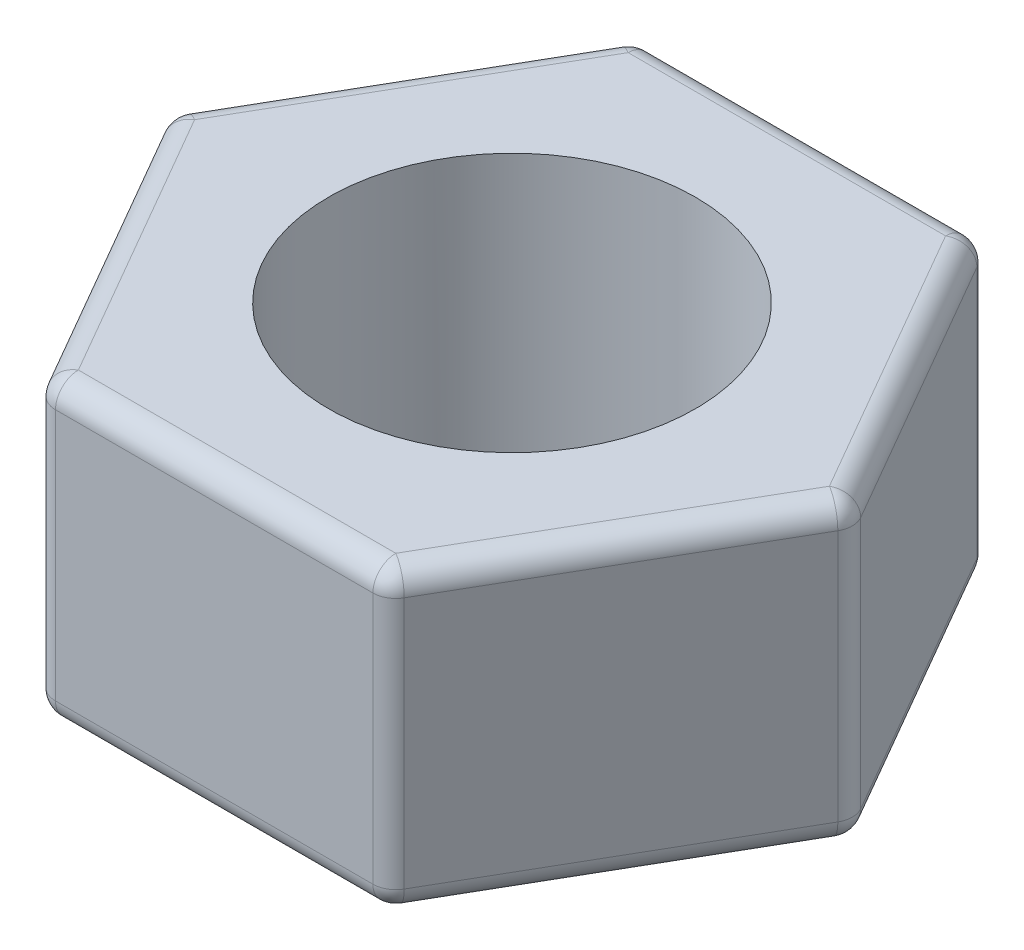
ISO-10303-21;
HEADER;
FILE_DESCRIPTION(('STEP AP214'),'2;1');
FILE_NAME('part.step','',(''),(''),'','','');
FILE_SCHEMA(('AUTOMOTIVE_DESIGN { 1 0 10303 214 1 1 1 1 }'));
ENDSEC;
DATA;
#1=APPLICATION_CONTEXT('core data for automotive mechanical design processes');
#2=APPLICATION_PROTOCOL_DEFINITION('international standard','automotive_design',2000,#1);
#3=PRODUCT_CONTEXT('',#1,'mechanical');
#4=PRODUCT('Part','Part','',(#3));
#5=PRODUCT_RELATED_PRODUCT_CATEGORY('part','',(#4));
#6=PRODUCT_DEFINITION_FORMATION('','',#4);
#7=PRODUCT_DEFINITION_CONTEXT('part definition',#1,'design');
#8=PRODUCT_DEFINITION('design','',#6,#7);
#9=PRODUCT_DEFINITION_SHAPE('','',#8);
#10=(LENGTH_UNIT() NAMED_UNIT(*) SI_UNIT(.MILLI.,.METRE.));
#11=(NAMED_UNIT(*) PLANE_ANGLE_UNIT() SI_UNIT($,.RADIAN.));
#12=(NAMED_UNIT(*) SI_UNIT($,.STERADIAN.) SOLID_ANGLE_UNIT());
#13=UNCERTAINTY_MEASURE_WITH_UNIT(LENGTH_MEASURE(1.E-05),#10,'distance_accuracy_value','');
#14=(GEOMETRIC_REPRESENTATION_CONTEXT(3) GLOBAL_UNCERTAINTY_ASSIGNED_CONTEXT((#13)) GLOBAL_UNIT_ASSIGNED_CONTEXT((#10,
#11,#12)) REPRESENTATION_CONTEXT('',''));
#15=CARTESIAN_POINT('',(0.,0.,0.));
#16=DIRECTION('',(0.,0.,1.));
#17=DIRECTION('',(1.,0.,0.));
#18=AXIS2_PLACEMENT_3D('',#15,#16,#17);
#19=CARTESIAN_POINT('',(3.75000000000008,6.5,6.49519052838325));
#20=DIRECTION('',(-0.866025403784442,0.,-0.499999999999995));
#21=DIRECTION('',(-0.499999999999995,0.,0.866025403784442));
#22=AXIS2_PLACEMENT_3D('',#19,#20,#21);
#23=PLANE('',#22);
#24=DIRECTION('',(0.499999999999995,0.,-0.866025403784442));
#25=VECTOR('',#24,1.);
#26=CARTESIAN_POINT('',(3.75000000000008,6.,6.49519052838325));
#27=LINE('',#26,#25);
#28=CARTESIAN_POINT('',(7.3556624327026,6.,0.249999999999999));
#29=VERTEX_POINT('',#28);
#30=CARTESIAN_POINT('',(3.89433756729748,6.,6.24519052838325));
#31=VERTEX_POINT('',#30);
#32=EDGE_CURVE('E189',#29,#31,#27,.F.);
#33=ORIENTED_EDGE('',*,*,#32,.T.);
#34=DIRECTION('',(0.,-1.,0.));
#35=VECTOR('',#34,1.);
#36=CARTESIAN_POINT('',(3.89433756729748,6.5,6.24519052838325));
#37=LINE('',#36,#35);
#38=CARTESIAN_POINT('',(3.89433756729748,0.5,6.24519052838325));
#39=VERTEX_POINT('',#38);
#40=EDGE_CURVE('E346',#31,#39,#37,.T.);
#41=ORIENTED_EDGE('',*,*,#40,.T.);
#42=DIRECTION('',(0.499999999999995,0.,-0.866025403784442));
#43=VECTOR('',#42,1.);
#44=CARTESIAN_POINT('',(3.75000000000008,0.5,6.49519052838325));
#45=LINE('',#44,#43);
#46=CARTESIAN_POINT('',(7.3556624327026,0.5,0.249999999999999));
#47=VERTEX_POINT('',#46);
#48=EDGE_CURVE('E343',#39,#47,#45,.T.);
#49=ORIENTED_EDGE('',*,*,#48,.T.);
#50=DIRECTION('',(0.,-1.,0.));
#51=VECTOR('',#50,1.);
#52=CARTESIAN_POINT('',(7.3556624327026,6.5,0.249999999999999));
#53=LINE('',#52,#51);
#54=EDGE_CURVE('E341',#47,#29,#53,.F.);
#55=ORIENTED_EDGE('',*,*,#54,.T.);
#56=EDGE_LOOP('',(#33,#41,#49,#55));
#57=FACE_BOUND('',#56,.T.);
#58=ADVANCED_FACE('F31',(#57),#23,.F.);
#59=CARTESIAN_POINT('',(7.5,6.5,0.));
#60=DIRECTION('',(-0.866025403784438,0.,0.500000000000001));
#61=DIRECTION('',(0.500000000000001,0.,0.866025403784438));
#62=AXIS2_PLACEMENT_3D('',#59,#60,#61);
#63=PLANE('',#62);
#64=DIRECTION('',(-0.500000000000001,0.,-0.866025403784438));
#65=VECTOR('',#64,1.);
#66=CARTESIAN_POINT('',(7.5,6.,0.));
#67=LINE('',#66,#65);
#68=CARTESIAN_POINT('',(3.89433756729739,6.,-6.2451905283833));
#69=VERTEX_POINT('',#68);
#70=CARTESIAN_POINT('',(7.35566243270259,6.,-0.249999999999999));
#71=VERTEX_POINT('',#70);
#72=EDGE_CURVE('E46',#69,#71,#67,.F.);
#73=ORIENTED_EDGE('',*,*,#72,.T.);
#74=DIRECTION('',(0.,-1.,0.));
#75=VECTOR('',#74,1.);
#76=CARTESIAN_POINT('',(7.35566243270259,6.5,-0.249999999999999));
#77=LINE('',#76,#75);
#78=CARTESIAN_POINT('',(7.35566243270259,0.5,-0.249999999999999));
#79=VERTEX_POINT('',#78);
#80=EDGE_CURVE('E267',#71,#79,#77,.T.);
#81=ORIENTED_EDGE('',*,*,#80,.T.);
#82=DIRECTION('',(-0.500000000000001,0.,-0.866025403784438));
#83=VECTOR('',#82,1.);
#84=CARTESIAN_POINT('',(7.5,0.5,0.));
#85=LINE('',#84,#83);
#86=CARTESIAN_POINT('',(3.89433756729739,0.5,-6.2451905283833));
#87=VERTEX_POINT('',#86);
#88=EDGE_CURVE('E362',#79,#87,#85,.T.);
#89=ORIENTED_EDGE('',*,*,#88,.T.);
#90=DIRECTION('',(0.,-1.,0.));
#91=VECTOR('',#90,1.);
#92=CARTESIAN_POINT('',(3.89433756729739,6.5,-6.2451905283833));
#93=LINE('',#92,#91);
#94=EDGE_CURVE('E51',#87,#69,#93,.F.);
#95=ORIENTED_EDGE('',*,*,#94,.T.);
#96=EDGE_LOOP('',(#73,#81,#89,#95));
#97=FACE_BOUND('',#96,.T.);
#98=ADVANCED_FACE('F364',(#97),#63,.F.);
#99=CARTESIAN_POINT('',(3.74999999999998,6.5,-6.4951905283833));
#100=DIRECTION('',(0.,0.,1.));
#101=DIRECTION('',(1.,0.,0.));
#102=AXIS2_PLACEMENT_3D('',#99,#100,#101);
#103=PLANE('',#102);
#104=DIRECTION('',(0.,-1.,0.));
#105=VECTOR('',#104,1.);
#106=CARTESIAN_POINT('',(-3.46132486540522,6.5,-6.49519052838327));
#107=LINE('',#106,#105);
#108=CARTESIAN_POINT('',(-3.46132486540522,0.5,-6.49519052838327));
#109=VERTEX_POINT('',#108);
#110=CARTESIAN_POINT('',(-3.46132486540522,6.,-6.49519052838327));
#111=VERTEX_POINT('',#110);
#112=EDGE_CURVE('E336',#109,#111,#107,.F.);
#113=ORIENTED_EDGE('',*,*,#112,.T.);
#114=DIRECTION('',(-1.,0.,0.));
#115=VECTOR('',#114,1.);
#116=CARTESIAN_POINT('',(3.74999999999998,6.,-6.4951905283833));
#117=LINE('',#116,#115);
#118=CARTESIAN_POINT('',(3.46132486540517,6.,-6.4951905283833));
#119=VERTEX_POINT('',#118);
#120=EDGE_CURVE('E338',#111,#119,#117,.F.);
#121=ORIENTED_EDGE('',*,*,#120,.T.);
#122=DIRECTION('',(0.,-1.,0.));
#123=VECTOR('',#122,1.);
#124=CARTESIAN_POINT('',(3.46132486540517,6.5,-6.4951905283833));
#125=LINE('',#124,#123);
#126=CARTESIAN_POINT('',(3.46132486540517,0.5,-6.4951905283833));
#127=VERTEX_POINT('',#126);
#128=EDGE_CURVE('E332',#119,#127,#125,.T.);
#129=ORIENTED_EDGE('',*,*,#128,.T.);
#130=DIRECTION('',(-1.,0.,0.));
#131=VECTOR('',#130,1.);
#132=CARTESIAN_POINT('',(3.74999999999998,0.5,-6.4951905283833));
#133=LINE('',#132,#131);
#134=EDGE_CURVE('E334',#127,#109,#133,.T.);
#135=ORIENTED_EDGE('',*,*,#134,.T.);
#136=EDGE_LOOP('',(#113,#121,#129,#135));
#137=FACE_BOUND('',#136,.T.);
#138=ADVANCED_FACE('F424',(#137),#103,.F.);
#139=CARTESIAN_POINT('',(-3.75000000000003,6.5,-6.49519052838327));
#140=DIRECTION('',(0.866025403784442,0.,0.499999999999995));
#141=DIRECTION('',(0.499999999999995,0.,-0.866025403784442));
#142=AXIS2_PLACEMENT_3D('',#139,#140,#141);
#143=PLANE('',#142);
#144=DIRECTION('',(0.,-1.,0.));
#145=VECTOR('',#144,1.);
#146=CARTESIAN_POINT('',(-7.3556624327026,6.5,-0.249999999999949));
#147=LINE('',#146,#145);
#148=CARTESIAN_POINT('',(-7.3556624327026,0.5,-0.249999999999949));
#149=VERTEX_POINT('',#148);
#150=CARTESIAN_POINT('',(-7.3556624327026,6.,-0.249999999999949));
#151=VERTEX_POINT('',#150);
#152=EDGE_CURVE('E327',#149,#151,#147,.F.);
#153=ORIENTED_EDGE('',*,*,#152,.T.);
#154=DIRECTION('',(-0.499999999999995,0.,0.866025403784442));
#155=VECTOR('',#154,1.);
#156=CARTESIAN_POINT('',(-3.75000000000003,6.,-6.49519052838327));
#157=LINE('',#156,#155);
#158=CARTESIAN_POINT('',(-3.89433756729743,6.,-6.24519052838327));
#159=VERTEX_POINT('',#158);
#160=EDGE_CURVE('E329',#151,#159,#157,.F.);
#161=ORIENTED_EDGE('',*,*,#160,.T.);
#162=DIRECTION('',(0.,-1.,0.));
#163=VECTOR('',#162,1.);
#164=CARTESIAN_POINT('',(-3.89433756729743,6.5,-6.24519052838327));
#165=LINE('',#164,#163);
#166=CARTESIAN_POINT('',(-3.89433756729743,0.5,-6.24519052838327));
#167=VERTEX_POINT('',#166);
#168=EDGE_CURVE('E325',#159,#167,#165,.T.);
#169=ORIENTED_EDGE('',*,*,#168,.T.);
#170=DIRECTION('',(-0.499999999999995,0.,0.866025403784442));
#171=VECTOR('',#170,1.);
#172=CARTESIAN_POINT('',(-3.75000000000003,0.5,-6.49519052838327));
#173=LINE('',#172,#171);
#174=EDGE_CURVE('E323',#167,#149,#173,.T.);
#175=ORIENTED_EDGE('',*,*,#174,.T.);
#176=EDGE_LOOP('',(#153,#161,#169,#175));
#177=FACE_BOUND('',#176,.T.);
#178=ADVANCED_FACE('F429',(#177),#143,.F.);
#179=CARTESIAN_POINT('',(-7.5,6.5,0.));
#180=DIRECTION('',(0.866025403784435,0.,-0.500000000000007));
#181=DIRECTION('',(-0.500000000000007,0.,-0.866025403784435));
#182=AXIS2_PLACEMENT_3D('',#179,#180,#181);
#183=PLANE('',#182);
#184=DIRECTION('',(0.,-1.,0.));
#185=VECTOR('',#184,1.);
#186=CARTESIAN_POINT('',(-3.89433756729735,6.5,6.24519052838333));
#187=LINE('',#186,#185);
#188=CARTESIAN_POINT('',(-3.89433756729735,0.5,6.24519052838333));
#189=VERTEX_POINT('',#188);
#190=CARTESIAN_POINT('',(-3.89433756729735,6.,6.24519052838333));
#191=VERTEX_POINT('',#190);
#192=EDGE_CURVE('E318',#189,#191,#187,.F.);
#193=ORIENTED_EDGE('',*,*,#192,.T.);
#194=DIRECTION('',(0.500000000000007,0.,0.866025403784435));
#195=VECTOR('',#194,1.);
#196=CARTESIAN_POINT('',(-7.5,6.,0.));
#197=LINE('',#196,#195);
#198=CARTESIAN_POINT('',(-7.35566243270259,6.,0.250000000000052));
#199=VERTEX_POINT('',#198);
#200=EDGE_CURVE('E320',#191,#199,#197,.F.);
#201=ORIENTED_EDGE('',*,*,#200,.T.);
#202=DIRECTION('',(0.,-1.,0.));
#203=VECTOR('',#202,1.);
#204=CARTESIAN_POINT('',(-7.35566243270259,6.5,0.250000000000052));
#205=LINE('',#204,#203);
#206=CARTESIAN_POINT('',(-7.35566243270259,0.5,0.250000000000052));
#207=VERTEX_POINT('',#206);
#208=EDGE_CURVE('E313',#199,#207,#205,.T.);
#209=ORIENTED_EDGE('',*,*,#208,.T.);
#210=DIRECTION('',(0.500000000000007,0.,0.866025403784435));
#211=VECTOR('',#210,1.);
#212=CARTESIAN_POINT('',(-7.5,0.5,0.));
#213=LINE('',#212,#211);
#214=EDGE_CURVE('E311',#207,#189,#213,.T.);
#215=ORIENTED_EDGE('',*,*,#214,.T.);
#216=EDGE_LOOP('',(#193,#201,#209,#215));
#217=FACE_BOUND('',#216,.T.);
#218=ADVANCED_FACE('F433',(#217),#183,.F.);
#219=CARTESIAN_POINT('',(-3.74999999999994,6.5,6.49519052838332));
#220=DIRECTION('',(0.,0.,-1.));
#221=DIRECTION('',(-1.,0.,0.));
#222=AXIS2_PLACEMENT_3D('',#219,#220,#221);
#223=PLANE('',#222);
#224=DIRECTION('',(0.,-1.,0.));
#225=VECTOR('',#224,1.);
#226=CARTESIAN_POINT('',(3.46132486540526,6.5,6.49519052838325));
#227=LINE('',#226,#225);
#228=CARTESIAN_POINT('',(3.46132486540526,0.5,6.49519052838325));
#229=VERTEX_POINT('',#228);
#230=CARTESIAN_POINT('',(3.46132486540526,6.,6.49519052838325));
#231=VERTEX_POINT('',#230);
#232=EDGE_CURVE('E303',#229,#231,#227,.F.);
#233=ORIENTED_EDGE('',*,*,#232,.T.);
#234=DIRECTION('',(1.,0.,0.));
#235=VECTOR('',#234,1.);
#236=CARTESIAN_POINT('',(-3.74999999999994,6.,6.49519052838332));
#237=LINE('',#236,#235);
#238=CARTESIAN_POINT('',(-3.46132486540513,6.,6.49519052838332));
#239=VERTEX_POINT('',#238);
#240=EDGE_CURVE('E302',#231,#239,#237,.F.);
#241=ORIENTED_EDGE('',*,*,#240,.T.);
#242=DIRECTION('',(0.,-1.,0.));
#243=VECTOR('',#242,1.);
#244=CARTESIAN_POINT('',(-3.46132486540513,6.5,6.49519052838332));
#245=LINE('',#244,#243);
#246=CARTESIAN_POINT('',(-3.46132486540513,0.5,6.49519052838332));
#247=VERTEX_POINT('',#246);
#248=EDGE_CURVE('E296',#239,#247,#245,.T.);
#249=ORIENTED_EDGE('',*,*,#248,.T.);
#250=DIRECTION('',(1.,0.,0.));
#251=VECTOR('',#250,1.);
#252=CARTESIAN_POINT('',(-3.74999999999994,0.5,6.49519052838332));
#253=LINE('',#252,#251);
#254=EDGE_CURVE('E392',#247,#229,#253,.T.);
#255=ORIENTED_EDGE('',*,*,#254,.T.);
#256=EDGE_LOOP('',(#233,#241,#249,#255));
#257=FACE_BOUND('',#256,.T.);
#258=ADVANCED_FACE('F306',(#257),#223,.F.);
#259=CARTESIAN_POINT('',(7.5,6.5,0.));
#260=DIRECTION('',(0.,1.,0.));
#261=DIRECTION('',(0.,0.,1.));
#262=AXIS2_PLACEMENT_3D('',#259,#260,#261);
#263=PLANE('',#262);
#264=CARTESIAN_POINT('',(0.,6.5,0.));
#265=DIRECTION('',(0.,-1.,0.));
#266=DIRECTION('',(0.,0.,-1.));
#267=AXIS2_PLACEMENT_3D('',#264,#265,#266);
#268=CIRCLE('',#267,4.);
#269=CARTESIAN_POINT('',(0.,6.5,-4.));
#270=VERTEX_POINT('',#269);
#271=EDGE_CURVE('E277',#270,#270,#268,.T.);
#272=ORIENTED_EDGE('',*,*,#271,.T.);
#273=EDGE_LOOP('',(#272));
#274=FACE_BOUND('',#273,.T.);
#275=DIRECTION('',(0.500000000000007,0.,0.866025403784435));
#276=VECTOR('',#275,1.);
#277=CARTESIAN_POINT('',(-3.31698729810772,6.5,6.24519052838332));
#278=LINE('',#277,#276);
#279=CARTESIAN_POINT('',(-6.92264973081037,6.5,0.));
#280=VERTEX_POINT('',#279);
#281=CARTESIAN_POINT('',(-3.46132486540513,6.5,5.99519052838332));
#282=VERTEX_POINT('',#281);
#283=EDGE_CURVE('E387',#280,#282,#278,.T.);
#284=ORIENTED_EDGE('',*,*,#283,.T.);
#285=DIRECTION('',(1.,0.,0.));
#286=VECTOR('',#285,1.);
#287=CARTESIAN_POINT('',(3.75000000000007,6.5,5.99519052838325));
#288=LINE('',#287,#286);
#289=CARTESIAN_POINT('',(3.46132486540526,6.5,5.99519052838325));
#290=VERTEX_POINT('',#289);
#291=EDGE_CURVE('E162',#282,#290,#288,.T.);
#292=ORIENTED_EDGE('',*,*,#291,.T.);
#293=DIRECTION('',(0.499999999999995,0.,-0.866025403784442));
#294=VECTOR('',#293,1.);
#295=CARTESIAN_POINT('',(7.06698729810778,6.5,-0.249999999999998));
#296=LINE('',#295,#294);
#297=CARTESIAN_POINT('',(6.92264973081037,6.5,0.));
#298=VERTEX_POINT('',#297);
#299=EDGE_CURVE('E156',#290,#298,#296,.T.);
#300=ORIENTED_EDGE('',*,*,#299,.T.);
#301=DIRECTION('',(-0.500000000000001,0.,-0.866025403784438));
#302=VECTOR('',#301,1.);
#303=CARTESIAN_POINT('',(3.31698729810777,6.5,-6.2451905283833));
#304=LINE('',#303,#302);
#305=CARTESIAN_POINT('',(3.46132486540517,6.5,-5.9951905283833));
#306=VERTEX_POINT('',#305);
#307=EDGE_CURVE('E159',#298,#306,#304,.T.);
#308=ORIENTED_EDGE('',*,*,#307,.T.);
#309=DIRECTION('',(-1.,0.,0.));
#310=VECTOR('',#309,1.);
#311=CARTESIAN_POINT('',(-3.75000000000003,6.5,-5.99519052838327));
#312=LINE('',#311,#310);
#313=CARTESIAN_POINT('',(-3.46132486540521,6.5,-5.99519052838327));
#314=VERTEX_POINT('',#313);
#315=EDGE_CURVE('E166',#306,#314,#312,.T.);
#316=ORIENTED_EDGE('',*,*,#315,.T.);
#317=DIRECTION('',(-0.499999999999995,0.,0.866025403784442));
#318=VECTOR('',#317,1.);
#319=CARTESIAN_POINT('',(-7.06698729810778,6.5,0.25000000000005));
#320=LINE('',#319,#318);
#321=EDGE_CURVE('E385',#314,#280,#320,.T.);
#322=ORIENTED_EDGE('',*,*,#321,.T.);
#323=EDGE_LOOP('',(#284,#292,#300,#308,#316,#322));
#324=FACE_BOUND('',#323,.T.);
#325=ADVANCED_FACE('F158',(#274,#324),#263,.T.);
#326=CARTESIAN_POINT('',(7.5,0.,0.));
#327=DIRECTION('',(0.,1.,0.));
#328=DIRECTION('',(0.,0.,1.));
#329=AXIS2_PLACEMENT_3D('',#326,#327,#328);
#330=PLANE('',#329);
#331=CARTESIAN_POINT('',(0.,0.,0.));
#332=DIRECTION('',(0.,1.,0.));
#333=DIRECTION('',(0.,0.,1.));
#334=AXIS2_PLACEMENT_3D('',#331,#332,#333);
#335=CIRCLE('',#334,4.5);
#336=CARTESIAN_POINT('',(0.,0.,4.5));
#337=VERTEX_POINT('',#336);
#338=EDGE_CURVE('E11',#337,#337,#335,.T.);
#339=ORIENTED_EDGE('',*,*,#338,.T.);
#340=EDGE_LOOP('',(#339));
#341=FACE_BOUND('',#340,.T.);
#342=DIRECTION('',(-0.499999999999995,0.,0.866025403784442));
#343=VECTOR('',#342,1.);
#344=CARTESIAN_POINT('',(-3.31698729810783,0.,-6.24519052838323));
#345=LINE('',#344,#343);
#346=CARTESIAN_POINT('',(-6.92264973081037,0.,0.));
#347=VERTEX_POINT('',#346);
#348=CARTESIAN_POINT('',(-3.46132486540521,0.,-5.99519052838327));
#349=VERTEX_POINT('',#348);
#350=EDGE_CURVE('E357',#347,#349,#345,.F.);
#351=ORIENTED_EDGE('',*,*,#350,.T.);
#352=DIRECTION('',(-1.,0.,0.));
#353=VECTOR('',#352,1.);
#354=CARTESIAN_POINT('',(7.49999999999998,0.,-5.99519052838331));
#355=LINE('',#354,#353);
#356=CARTESIAN_POINT('',(3.46132486540517,0.,-5.9951905283833));
#357=VERTEX_POINT('',#356);
#358=EDGE_CURVE('E359',#349,#357,#355,.F.);
#359=ORIENTED_EDGE('',*,*,#358,.T.);
#360=DIRECTION('',(-0.500000000000001,0.,-0.866025403784438));
#361=VECTOR('',#360,1.);
#362=CARTESIAN_POINT('',(7.06698729810778,0.,0.250000000000002));
#363=LINE('',#362,#361);
#364=CARTESIAN_POINT('',(6.92264973081037,0.,0.));
#365=VERTEX_POINT('',#364);
#366=EDGE_CURVE('E349',#357,#365,#363,.F.);
#367=ORIENTED_EDGE('',*,*,#366,.T.);
#368=DIRECTION('',(0.499999999999995,0.,-0.866025403784442));
#369=VECTOR('',#368,1.);
#370=CARTESIAN_POINT('',(7.06698729810778,0.,-0.249999999999997));
#371=LINE('',#370,#369);
#372=CARTESIAN_POINT('',(3.46132486540526,0.,5.99519052838325));
#373=VERTEX_POINT('',#372);
#374=EDGE_CURVE('E351',#365,#373,#371,.F.);
#375=ORIENTED_EDGE('',*,*,#374,.T.);
#376=DIRECTION('',(1.,0.,0.));
#377=VECTOR('',#376,1.);
#378=CARTESIAN_POINT('',(7.50000000000006,0.,5.99519052838321));
#379=LINE('',#378,#377);
#380=CARTESIAN_POINT('',(-3.46132486540513,0.,5.99519052838332));
#381=VERTEX_POINT('',#380);
#382=EDGE_CURVE('E353',#373,#381,#379,.F.);
#383=ORIENTED_EDGE('',*,*,#382,.T.);
#384=DIRECTION('',(0.500000000000007,0.,0.866025403784435));
#385=VECTOR('',#384,1.);
#386=CARTESIAN_POINT('',(-3.3169872981077,0.,6.24519052838336));
#387=LINE('',#386,#385);
#388=EDGE_CURVE('E355',#381,#347,#387,.F.);
#389=ORIENTED_EDGE('',*,*,#388,.T.);
#390=EDGE_LOOP('',(#351,#359,#367,#375,#383,#389));
#391=FACE_BOUND('',#390,.T.);
#392=ADVANCED_FACE('F440',(#341,#391),#330,.F.);
#393=CARTESIAN_POINT('',(3.74999999999999,0.5,-5.9951905283833));
#394=DIRECTION('',(-1.,0.,0.));
#395=DIRECTION('',(0.,0.,1.));
#396=AXIS2_PLACEMENT_3D('',#393,#394,#395);
#397=CYLINDRICAL_SURFACE('',#396,0.5);
#398=CARTESIAN_POINT('',(-3.46132486540521,0.5,-5.99519052838327));
#399=DIRECTION('',(-1.,0.,0.));
#400=DIRECTION('',(0.,0.,1.));
#401=AXIS2_PLACEMENT_3D('',#398,#399,#400);
#402=CIRCLE('',#401,0.5);
#403=EDGE_CURVE('E177',#109,#349,#402,.T.);
#404=ORIENTED_EDGE('',*,*,#403,.F.);
#405=ORIENTED_EDGE('',*,*,#134,.F.);
#406=CARTESIAN_POINT('',(3.46132486540517,0.5,-5.9951905283833));
#407=DIRECTION('',(1.,0.,0.));
#408=DIRECTION('',(0.,0.,-1.));
#409=AXIS2_PLACEMENT_3D('',#406,#407,#408);
#410=CIRCLE('',#409,0.5);
#411=EDGE_CURVE('E262',#357,#127,#410,.T.);
#412=ORIENTED_EDGE('',*,*,#411,.F.);
#413=ORIENTED_EDGE('',*,*,#358,.F.);
#414=EDGE_LOOP('',(#404,#405,#412,#413));
#415=FACE_BOUND('',#414,.T.);
#416=ADVANCED_FACE('F443',(#415),#397,.T.);
#417=CARTESIAN_POINT('',(-3.46132486540521,0.5,-5.99519052838327));
#418=DIRECTION('',(0.,0.,1.));
#419=DIRECTION('',(1.,0.,0.));
#420=AXIS2_PLACEMENT_3D('',#417,#418,#419);
#421=SPHERICAL_SURFACE('',#420,0.5);
#422=CARTESIAN_POINT('',(-3.46132486540521,0.5,-5.99519052838327));
#423=DIRECTION('',(0.,-1.,0.));
#424=DIRECTION('',(0.,0.,-1.));
#425=AXIS2_PLACEMENT_3D('',#422,#423,#424);
#426=CIRCLE('',#425,0.5);
#427=EDGE_CURVE('E256',#109,#167,#426,.F.);
#428=ORIENTED_EDGE('',*,*,#427,.F.);
#429=ORIENTED_EDGE('',*,*,#403,.T.);
#430=CARTESIAN_POINT('',(-3.46132486540521,0.5,-5.99519052838327));
#431=DIRECTION('',(0.499999999999995,0.,-0.866025403784441));
#432=DIRECTION('',(-0.866025403784442,0.,-0.499999999999995));
#433=AXIS2_PLACEMENT_3D('',#430,#431,#432);
#434=CIRCLE('',#433,0.5);
#435=EDGE_CURVE('E259',#167,#349,#434,.F.);
#436=ORIENTED_EDGE('',*,*,#435,.F.);
#437=EDGE_LOOP('',(#428,#429,#436));
#438=FACE_BOUND('',#437,.T.);
#439=ADVANCED_FACE('F466',(#438),#421,.T.);
#440=CARTESIAN_POINT('',(3.46132486540517,0.5,-5.9951905283833));
#441=DIRECTION('',(0.,0.,1.));
#442=DIRECTION('',(1.,0.,0.));
#443=AXIS2_PLACEMENT_3D('',#440,#441,#442);
#444=SPHERICAL_SURFACE('',#443,0.5);
#445=CARTESIAN_POINT('',(3.46132486540517,0.5,-5.9951905283833));
#446=DIRECTION('',(-0.500000000000001,0.,-0.866025403784438));
#447=DIRECTION('',(-0.866025403784438,0.,0.500000000000001));
#448=AXIS2_PLACEMENT_3D('',#445,#446,#447);
#449=CIRCLE('',#448,0.5);
#450=EDGE_CURVE('E250',#357,#87,#449,.F.);
#451=ORIENTED_EDGE('',*,*,#450,.F.);
#452=ORIENTED_EDGE('',*,*,#411,.T.);
#453=CARTESIAN_POINT('',(3.46132486540517,0.5,-5.9951905283833));
#454=DIRECTION('',(0.,-1.,0.));
#455=DIRECTION('',(0.,0.,-1.));
#456=AXIS2_PLACEMENT_3D('',#453,#454,#455);
#457=CIRCLE('',#456,0.5);
#458=EDGE_CURVE('E253',#87,#127,#457,.F.);
#459=ORIENTED_EDGE('',*,*,#458,.F.);
#460=EDGE_LOOP('',(#451,#452,#459));
#461=FACE_BOUND('',#460,.T.);
#462=ADVANCED_FACE('F372',(#461),#444,.T.);
#463=CARTESIAN_POINT('',(-3.31698729810781,0.5,-6.24519052838327));
#464=DIRECTION('',(-0.499999999999995,0.,0.866025403784442));
#465=DIRECTION('',(0.866025403784442,0.,0.499999999999995));
#466=AXIS2_PLACEMENT_3D('',#463,#464,#465);
#467=CYLINDRICAL_SURFACE('',#466,0.5);
#468=ORIENTED_EDGE('',*,*,#435,.T.);
#469=ORIENTED_EDGE('',*,*,#350,.F.);
#470=CARTESIAN_POINT('',(-6.92264973081037,0.5,0.));
#471=DIRECTION('',(-0.499999999999995,0.,0.866025403784441));
#472=DIRECTION('',(0.866025403784441,0.,0.499999999999995));
#473=AXIS2_PLACEMENT_3D('',#470,#471,#472);
#474=CIRCLE('',#473,0.5);
#475=EDGE_CURVE('E247',#149,#347,#474,.T.);
#476=ORIENTED_EDGE('',*,*,#475,.F.);
#477=ORIENTED_EDGE('',*,*,#174,.F.);
#478=EDGE_LOOP('',(#468,#469,#476,#477));
#479=FACE_BOUND('',#478,.T.);
#480=ADVANCED_FACE('F480',(#479),#467,.T.);
#481=CARTESIAN_POINT('',(-3.46132486540521,6.5,-5.99519052838327));
#482=DIRECTION('',(0.,-1.,0.));
#483=DIRECTION('',(0.,0.,-1.));
#484=AXIS2_PLACEMENT_3D('',#481,#482,#483);
#485=CYLINDRICAL_SURFACE('',#484,0.5);
#486=ORIENTED_EDGE('',*,*,#427,.T.);
#487=ORIENTED_EDGE('',*,*,#168,.F.);
#488=CARTESIAN_POINT('',(-3.46132486540521,6.,-5.99519052838327));
#489=DIRECTION('',(0.,1.,0.));
#490=DIRECTION('',(0.,0.,1.));
#491=AXIS2_PLACEMENT_3D('',#488,#489,#490);
#492=CIRCLE('',#491,0.5);
#493=EDGE_CURVE('E244',#111,#159,#492,.T.);
#494=ORIENTED_EDGE('',*,*,#493,.F.);
#495=ORIENTED_EDGE('',*,*,#112,.F.);
#496=EDGE_LOOP('',(#486,#487,#494,#495));
#497=FACE_BOUND('',#496,.T.);
#498=ADVANCED_FACE('F487',(#497),#485,.T.);
#499=CARTESIAN_POINT('',(7.49999999999998,6.,-5.99519052838331));
#500=DIRECTION('',(1.,0.,0.));
#501=DIRECTION('',(0.,0.,-1.));
#502=AXIS2_PLACEMENT_3D('',#499,#500,#501);
#503=CYLINDRICAL_SURFACE('',#502,0.5);
#504=CARTESIAN_POINT('',(3.46132486540517,6.,-5.9951905283833));
#505=DIRECTION('',(1.,0.,0.));
#506=DIRECTION('',(0.,0.,-1.));
#507=AXIS2_PLACEMENT_3D('',#504,#505,#506);
#508=CIRCLE('',#507,0.5);
#509=EDGE_CURVE('E238',#119,#306,#508,.T.);
#510=ORIENTED_EDGE('',*,*,#509,.F.);
#511=ORIENTED_EDGE('',*,*,#120,.F.);
#512=CARTESIAN_POINT('',(-3.46132486540521,6.,-5.99519052838327));
#513=DIRECTION('',(-1.,0.,0.));
#514=DIRECTION('',(0.,0.,1.));
#515=AXIS2_PLACEMENT_3D('',#512,#513,#514);
#516=CIRCLE('',#515,0.5);
#517=EDGE_CURVE('E241',#314,#111,#516,.T.);
#518=ORIENTED_EDGE('',*,*,#517,.F.);
#519=ORIENTED_EDGE('',*,*,#315,.F.);
#520=EDGE_LOOP('',(#510,#511,#518,#519));
#521=FACE_BOUND('',#520,.T.);
#522=ADVANCED_FACE('F381',(#521),#503,.T.);
#523=CARTESIAN_POINT('',(3.46132486540517,6.5,-5.9951905283833));
#524=DIRECTION('',(0.,-1.,0.));
#525=DIRECTION('',(0.,0.,-1.));
#526=AXIS2_PLACEMENT_3D('',#523,#524,#525);
#527=CYLINDRICAL_SURFACE('',#526,0.5);
#528=ORIENTED_EDGE('',*,*,#458,.T.);
#529=ORIENTED_EDGE('',*,*,#128,.F.);
#530=CARTESIAN_POINT('',(3.46132486540517,6.,-5.9951905283833));
#531=DIRECTION('',(0.,1.,0.));
#532=DIRECTION('',(0.,0.,1.));
#533=AXIS2_PLACEMENT_3D('',#530,#531,#532);
#534=CIRCLE('',#533,0.5);
#535=EDGE_CURVE('E236',#69,#119,#534,.T.);
#536=ORIENTED_EDGE('',*,*,#535,.F.);
#537=ORIENTED_EDGE('',*,*,#94,.F.);
#538=EDGE_LOOP('',(#528,#529,#536,#537));
#539=FACE_BOUND('',#538,.T.);
#540=ADVANCED_FACE('F375',(#539),#527,.T.);
#541=CARTESIAN_POINT('',(7.06698729810778,0.5,0.25));
#542=DIRECTION('',(-0.500000000000001,0.,-0.866025403784438));
#543=DIRECTION('',(-0.866025403784438,0.,0.500000000000001));
#544=AXIS2_PLACEMENT_3D('',#541,#542,#543);
#545=CYLINDRICAL_SURFACE('',#544,0.5);
#546=ORIENTED_EDGE('',*,*,#450,.T.);
#547=ORIENTED_EDGE('',*,*,#88,.F.);
#548=CARTESIAN_POINT('',(6.92264973081037,0.5,0.));
#549=DIRECTION('',(0.500000000000001,0.,0.866025403784438));
#550=DIRECTION('',(0.866025403784438,0.,-0.500000000000001));
#551=AXIS2_PLACEMENT_3D('',#548,#549,#550);
#552=CIRCLE('',#551,0.5);
#553=EDGE_CURVE('E233',#365,#79,#552,.T.);
#554=ORIENTED_EDGE('',*,*,#553,.F.);
#555=ORIENTED_EDGE('',*,*,#366,.F.);
#556=EDGE_LOOP('',(#546,#547,#554,#555));
#557=FACE_BOUND('',#556,.T.);
#558=ADVANCED_FACE('F369',(#557),#545,.T.);
#559=CARTESIAN_POINT('',(-6.92264973081037,0.5,0.));
#560=DIRECTION('',(0.,0.,1.));
#561=DIRECTION('',(1.,0.,0.));
#562=AXIS2_PLACEMENT_3D('',#559,#560,#561);
#563=SPHERICAL_SURFACE('',#562,0.5);
#564=CARTESIAN_POINT('',(-6.92264973081037,0.5,0.));
#565=DIRECTION('',(0.,-1.,0.));
#566=DIRECTION('',(0.,0.,-1.));
#567=AXIS2_PLACEMENT_3D('',#564,#565,#566);
#568=CIRCLE('',#567,0.5);
#569=EDGE_CURVE('E227',#149,#207,#568,.F.);
#570=ORIENTED_EDGE('',*,*,#569,.F.);
#571=ORIENTED_EDGE('',*,*,#475,.T.);
#572=CARTESIAN_POINT('',(-6.92264973081037,0.5,0.));
#573=DIRECTION('',(-0.500000000000007,0.,-0.866025403784434));
#574=DIRECTION('',(-0.866025403784435,0.,0.500000000000007));
#575=AXIS2_PLACEMENT_3D('',#572,#573,#574);
#576=CIRCLE('',#575,0.5);
#577=EDGE_CURVE('E230',#207,#347,#576,.F.);
#578=ORIENTED_EDGE('',*,*,#577,.F.);
#579=EDGE_LOOP('',(#570,#571,#578));
#580=FACE_BOUND('',#579,.T.);
#581=ADVANCED_FACE('F514',(#580),#563,.T.);
#582=CARTESIAN_POINT('',(-3.46132486540521,6.,-5.99519052838327));
#583=DIRECTION('',(0.,0.,1.));
#584=DIRECTION('',(1.,0.,0.));
#585=AXIS2_PLACEMENT_3D('',#582,#583,#584);
#586=SPHERICAL_SURFACE('',#585,0.5);
#587=ORIENTED_EDGE('',*,*,#517,.T.);
#588=ORIENTED_EDGE('',*,*,#493,.T.);
#589=CARTESIAN_POINT('',(-3.46132486540521,6.,-5.99519052838327));
#590=DIRECTION('',(0.499999999999995,0.,-0.866025403784441));
#591=DIRECTION('',(-0.866025403784442,0.,-0.499999999999995));
#592=AXIS2_PLACEMENT_3D('',#589,#590,#591);
#593=CIRCLE('',#592,0.5);
#594=EDGE_CURVE('E225',#314,#159,#593,.F.);
#595=ORIENTED_EDGE('',*,*,#594,.F.);
#596=EDGE_LOOP('',(#587,#588,#595));
#597=FACE_BOUND('',#596,.T.);
#598=ADVANCED_FACE('F521',(#597),#586,.T.);
#599=CARTESIAN_POINT('',(3.46132486540517,6.,-5.9951905283833));
#600=DIRECTION('',(0.,0.,1.));
#601=DIRECTION('',(1.,0.,0.));
#602=AXIS2_PLACEMENT_3D('',#599,#600,#601);
#603=SPHERICAL_SURFACE('',#602,0.5);
#604=ORIENTED_EDGE('',*,*,#535,.T.);
#605=ORIENTED_EDGE('',*,*,#509,.T.);
#606=CARTESIAN_POINT('',(3.46132486540517,6.,-5.9951905283833));
#607=DIRECTION('',(-0.500000000000001,0.,-0.866025403784438));
#608=DIRECTION('',(-0.866025403784438,0.,0.500000000000001));
#609=AXIS2_PLACEMENT_3D('',#606,#607,#608);
#610=CIRCLE('',#609,0.5);
#611=EDGE_CURVE('E176',#69,#306,#610,.F.);
#612=ORIENTED_EDGE('',*,*,#611,.F.);
#613=EDGE_LOOP('',(#604,#605,#612));
#614=FACE_BOUND('',#613,.T.);
#615=ADVANCED_FACE('F378',(#614),#603,.T.);
#616=CARTESIAN_POINT('',(6.92264973081037,0.5,0.));
#617=DIRECTION('',(0.,0.,1.));
#618=DIRECTION('',(1.,0.,0.));
#619=AXIS2_PLACEMENT_3D('',#616,#617,#618);
#620=SPHERICAL_SURFACE('',#619,0.5);
#621=CARTESIAN_POINT('',(6.92264973081038,0.5,0.));
#622=DIRECTION('',(0.499999999999995,0.,-0.866025403784441));
#623=DIRECTION('',(-0.866025403784441,0.,-0.499999999999995));
#624=AXIS2_PLACEMENT_3D('',#621,#622,#623);
#625=CIRCLE('',#624,0.5);
#626=EDGE_CURVE('E219',#365,#47,#625,.F.);
#627=ORIENTED_EDGE('',*,*,#626,.F.);
#628=ORIENTED_EDGE('',*,*,#553,.T.);
#629=CARTESIAN_POINT('',(6.92264973081037,0.5,0.));
#630=DIRECTION('',(0.,-1.,0.));
#631=DIRECTION('',(0.,0.,-1.));
#632=AXIS2_PLACEMENT_3D('',#629,#630,#631);
#633=CIRCLE('',#632,0.5);
#634=EDGE_CURVE('E222',#47,#79,#633,.F.);
#635=ORIENTED_EDGE('',*,*,#634,.F.);
#636=EDGE_LOOP('',(#627,#628,#635));
#637=FACE_BOUND('',#636,.T.);
#638=ADVANCED_FACE('F536',(#637),#620,.T.);
#639=CARTESIAN_POINT('',(-7.06698729810778,0.5,-0.249999999999951));
#640=DIRECTION('',(0.500000000000007,0.,0.866025403784435));
#641=DIRECTION('',(0.866025403784435,0.,-0.500000000000007));
#642=AXIS2_PLACEMENT_3D('',#639,#640,#641);
#643=CYLINDRICAL_SURFACE('',#642,0.5);
#644=ORIENTED_EDGE('',*,*,#577,.T.);
#645=ORIENTED_EDGE('',*,*,#388,.F.);
#646=CARTESIAN_POINT('',(-3.46132486540513,0.5,5.99519052838332));
#647=DIRECTION('',(0.500000000000007,0.,0.866025403784434));
#648=DIRECTION('',(0.866025403784434,0.,-0.500000000000008));
#649=AXIS2_PLACEMENT_3D('',#646,#647,#648);
#650=CIRCLE('',#649,0.5);
#651=EDGE_CURVE('E213',#189,#381,#650,.T.);
#652=ORIENTED_EDGE('',*,*,#651,.F.);
#653=ORIENTED_EDGE('',*,*,#214,.F.);
#654=EDGE_LOOP('',(#644,#645,#652,#653));
#655=FACE_BOUND('',#654,.T.);
#656=ADVANCED_FACE('F543',(#655),#643,.T.);
#657=CARTESIAN_POINT('',(-6.92264973081037,6.5,0.));
#658=DIRECTION('',(0.,-1.,0.));
#659=DIRECTION('',(0.,0.,-1.));
#660=AXIS2_PLACEMENT_3D('',#657,#658,#659);
#661=CYLINDRICAL_SURFACE('',#660,0.5);
#662=ORIENTED_EDGE('',*,*,#569,.T.);
#663=ORIENTED_EDGE('',*,*,#208,.F.);
#664=CARTESIAN_POINT('',(-6.92264973081037,6.,0.));
#665=DIRECTION('',(0.,1.,0.));
#666=DIRECTION('',(0.,0.,1.));
#667=AXIS2_PLACEMENT_3D('',#664,#665,#666);
#668=CIRCLE('',#667,0.5);
#669=EDGE_CURVE('E210',#151,#199,#668,.T.);
#670=ORIENTED_EDGE('',*,*,#669,.F.);
#671=ORIENTED_EDGE('',*,*,#152,.F.);
#672=EDGE_LOOP('',(#662,#663,#670,#671));
#673=FACE_BOUND('',#672,.T.);
#674=ADVANCED_FACE('F551',(#673),#661,.T.);
#675=CARTESIAN_POINT('',(-3.31698729810783,6.,-6.24519052838323));
#676=DIRECTION('',(0.499999999999995,0.,-0.866025403784442));
#677=DIRECTION('',(-0.866025403784442,0.,-0.499999999999995));
#678=AXIS2_PLACEMENT_3D('',#675,#676,#677);
#679=CYLINDRICAL_SURFACE('',#678,0.5);
#680=ORIENTED_EDGE('',*,*,#594,.T.);
#681=ORIENTED_EDGE('',*,*,#160,.F.);
#682=CARTESIAN_POINT('',(-6.92264973081037,6.,0.));
#683=DIRECTION('',(-0.499999999999996,0.,0.866025403784441));
#684=DIRECTION('',(0.866025403784441,0.,0.499999999999996));
#685=AXIS2_PLACEMENT_3D('',#682,#683,#684);
#686=CIRCLE('',#685,0.5);
#687=EDGE_CURVE('E186',#280,#151,#686,.T.);
#688=ORIENTED_EDGE('',*,*,#687,.F.);
#689=ORIENTED_EDGE('',*,*,#321,.F.);
#690=EDGE_LOOP('',(#680,#681,#688,#689));
#691=FACE_BOUND('',#690,.T.);
#692=ADVANCED_FACE('F559',(#691),#679,.T.);
#693=CARTESIAN_POINT('',(7.06698729810778,6.,0.250000000000002));
#694=DIRECTION('',(0.500000000000001,0.,0.866025403784438));
#695=DIRECTION('',(0.866025403784438,0.,-0.500000000000001));
#696=AXIS2_PLACEMENT_3D('',#693,#694,#695);
#697=CYLINDRICAL_SURFACE('',#696,0.5);
#698=ORIENTED_EDGE('',*,*,#611,.T.);
#699=ORIENTED_EDGE('',*,*,#307,.F.);
#700=CARTESIAN_POINT('',(6.92264973081037,6.,0.));
#701=DIRECTION('',(0.500000000000001,0.,0.866025403784438));
#702=DIRECTION('',(0.866025403784438,0.,-0.500000000000001));
#703=AXIS2_PLACEMENT_3D('',#700,#701,#702);
#704=CIRCLE('',#703,0.5);
#705=EDGE_CURVE('E173',#71,#298,#704,.T.);
#706=ORIENTED_EDGE('',*,*,#705,.F.);
#707=ORIENTED_EDGE('',*,*,#72,.F.);
#708=EDGE_LOOP('',(#698,#699,#706,#707));
#709=FACE_BOUND('',#708,.T.);
#710=ADVANCED_FACE('F172',(#709),#697,.T.);
#711=CARTESIAN_POINT('',(6.92264973081037,6.5,0.));
#712=DIRECTION('',(0.,-1.,0.));
#713=DIRECTION('',(0.,0.,-1.));
#714=AXIS2_PLACEMENT_3D('',#711,#712,#713);
#715=CYLINDRICAL_SURFACE('',#714,0.5);
#716=ORIENTED_EDGE('',*,*,#634,.T.);
#717=ORIENTED_EDGE('',*,*,#80,.F.);
#718=CARTESIAN_POINT('',(6.92264973081038,6.,0.));
#719=DIRECTION('',(0.,1.,0.));
#720=DIRECTION('',(0.,0.,1.));
#721=AXIS2_PLACEMENT_3D('',#718,#719,#720);
#722=CIRCLE('',#721,0.5);
#723=EDGE_CURVE('E185',#29,#71,#722,.T.);
#724=ORIENTED_EDGE('',*,*,#723,.F.);
#725=ORIENTED_EDGE('',*,*,#54,.F.);
#726=EDGE_LOOP('',(#716,#717,#724,#725));
#727=FACE_BOUND('',#726,.T.);
#728=ADVANCED_FACE('F574',(#727),#715,.T.);
#729=CARTESIAN_POINT('',(3.31698729810785,0.5,6.24519052838325));
#730=DIRECTION('',(0.499999999999995,0.,-0.866025403784442));
#731=DIRECTION('',(-0.866025403784442,0.,-0.499999999999995));
#732=AXIS2_PLACEMENT_3D('',#729,#730,#731);
#733=CYLINDRICAL_SURFACE('',#732,0.5);
#734=ORIENTED_EDGE('',*,*,#626,.T.);
#735=ORIENTED_EDGE('',*,*,#48,.F.);
#736=CARTESIAN_POINT('',(3.46132486540526,0.5,5.99519052838325));
#737=DIRECTION('',(-0.499999999999995,0.,0.866025403784441));
#738=DIRECTION('',(0.866025403784441,0.,0.499999999999995));
#739=AXIS2_PLACEMENT_3D('',#736,#737,#738);
#740=CIRCLE('',#739,0.5);
#741=EDGE_CURVE('E204',#373,#39,#740,.T.);
#742=ORIENTED_EDGE('',*,*,#741,.F.);
#743=ORIENTED_EDGE('',*,*,#374,.F.);
#744=EDGE_LOOP('',(#734,#735,#742,#743));
#745=FACE_BOUND('',#744,.T.);
#746=ADVANCED_FACE('F581',(#745),#733,.T.);
#747=CARTESIAN_POINT('',(-3.74999999999994,0.5,5.99519052838332));
#748=DIRECTION('',(1.,0.,0.));
#749=DIRECTION('',(0.,0.,-1.));
#750=AXIS2_PLACEMENT_3D('',#747,#748,#749);
#751=CYLINDRICAL_SURFACE('',#750,0.5);
#752=CARTESIAN_POINT('',(-3.46132486540513,0.5,5.99519052838332));
#753=DIRECTION('',(-1.,0.,0.));
#754=DIRECTION('',(0.,0.,1.));
#755=AXIS2_PLACEMENT_3D('',#752,#753,#754);
#756=CIRCLE('',#755,0.5);
#757=EDGE_CURVE('E216',#381,#247,#756,.T.);
#758=ORIENTED_EDGE('',*,*,#757,.F.);
#759=ORIENTED_EDGE('',*,*,#382,.F.);
#760=CARTESIAN_POINT('',(3.46132486540526,0.5,5.99519052838325));
#761=DIRECTION('',(1.,0.,0.));
#762=DIRECTION('',(0.,0.,-1.));
#763=AXIS2_PLACEMENT_3D('',#760,#761,#762);
#764=CIRCLE('',#763,0.5);
#765=EDGE_CURVE('E201',#229,#373,#764,.T.);
#766=ORIENTED_EDGE('',*,*,#765,.F.);
#767=ORIENTED_EDGE('',*,*,#254,.F.);
#768=EDGE_LOOP('',(#758,#759,#766,#767));
#769=FACE_BOUND('',#768,.T.);
#770=ADVANCED_FACE('F398',(#769),#751,.T.);
#771=CARTESIAN_POINT('',(-3.46132486540513,0.5,5.99519052838332));
#772=DIRECTION('',(0.,0.,1.));
#773=DIRECTION('',(1.,0.,0.));
#774=AXIS2_PLACEMENT_3D('',#771,#772,#773);
#775=SPHERICAL_SURFACE('',#774,0.5);
#776=ORIENTED_EDGE('',*,*,#651,.T.);
#777=ORIENTED_EDGE('',*,*,#757,.T.);
#778=CARTESIAN_POINT('',(-3.46132486540513,0.5,5.99519052838332));
#779=DIRECTION('',(0.,-1.,0.));
#780=DIRECTION('',(0.,0.,-1.));
#781=AXIS2_PLACEMENT_3D('',#778,#779,#780);
#782=CIRCLE('',#781,0.5);
#783=EDGE_CURVE('E193',#189,#247,#782,.F.);
#784=ORIENTED_EDGE('',*,*,#783,.F.);
#785=EDGE_LOOP('',(#776,#777,#784));
#786=FACE_BOUND('',#785,.T.);
#787=ADVANCED_FACE('F596',(#786),#775,.T.);
#788=CARTESIAN_POINT('',(-6.92264973081037,6.,0.));
#789=DIRECTION('',(0.,0.,1.));
#790=DIRECTION('',(1.,0.,0.));
#791=AXIS2_PLACEMENT_3D('',#788,#789,#790);
#792=SPHERICAL_SURFACE('',#791,0.5);
#793=ORIENTED_EDGE('',*,*,#687,.T.);
#794=ORIENTED_EDGE('',*,*,#669,.T.);
#795=CARTESIAN_POINT('',(-6.92264973081037,6.,0.));
#796=DIRECTION('',(-0.500000000000007,0.,-0.866025403784434));
#797=DIRECTION('',(-0.866025403784434,0.,0.500000000000007));
#798=AXIS2_PLACEMENT_3D('',#795,#796,#797);
#799=CIRCLE('',#798,0.5);
#800=EDGE_CURVE('E190',#280,#199,#799,.F.);
#801=ORIENTED_EDGE('',*,*,#800,.F.);
#802=EDGE_LOOP('',(#793,#794,#801));
#803=FACE_BOUND('',#802,.T.);
#804=ADVANCED_FACE('F603',(#803),#792,.T.);
#805=CARTESIAN_POINT('',(6.92264973081037,6.,0.));
#806=DIRECTION('',(0.,0.,1.));
#807=DIRECTION('',(1.,0.,0.));
#808=AXIS2_PLACEMENT_3D('',#805,#806,#807);
#809=SPHERICAL_SURFACE('',#808,0.5);
#810=ORIENTED_EDGE('',*,*,#723,.T.);
#811=ORIENTED_EDGE('',*,*,#705,.T.);
#812=CARTESIAN_POINT('',(6.92264973081037,6.,0.));
#813=DIRECTION('',(0.499999999999995,0.,-0.866025403784441));
#814=DIRECTION('',(-0.866025403784441,0.,-0.499999999999995));
#815=AXIS2_PLACEMENT_3D('',#812,#813,#814);
#816=CIRCLE('',#815,0.5);
#817=EDGE_CURVE('E182',#29,#298,#816,.F.);
#818=ORIENTED_EDGE('',*,*,#817,.F.);
#819=EDGE_LOOP('',(#810,#811,#818));
#820=FACE_BOUND('',#819,.T.);
#821=ADVANCED_FACE('F181',(#820),#809,.T.);
#822=CARTESIAN_POINT('',(3.46132486540526,0.5,5.99519052838325));
#823=DIRECTION('',(0.,0.,1.));
#824=DIRECTION('',(1.,0.,0.));
#825=AXIS2_PLACEMENT_3D('',#822,#823,#824);
#826=SPHERICAL_SURFACE('',#825,0.5);
#827=ORIENTED_EDGE('',*,*,#765,.T.);
#828=ORIENTED_EDGE('',*,*,#741,.T.);
#829=CARTESIAN_POINT('',(3.46132486540526,0.5,5.99519052838325));
#830=DIRECTION('',(0.,-1.,0.));
#831=DIRECTION('',(0.,0.,-1.));
#832=AXIS2_PLACEMENT_3D('',#829,#830,#831);
#833=CIRCLE('',#832,0.5);
#834=EDGE_CURVE('E191',#229,#39,#833,.F.);
#835=ORIENTED_EDGE('',*,*,#834,.F.);
#836=EDGE_LOOP('',(#827,#828,#835));
#837=FACE_BOUND('',#836,.T.);
#838=ADVANCED_FACE('F401',(#837),#826,.T.);
#839=CARTESIAN_POINT('',(-3.46132486540513,6.5,5.99519052838332));
#840=DIRECTION('',(0.,-1.,0.));
#841=DIRECTION('',(0.,0.,-1.));
#842=AXIS2_PLACEMENT_3D('',#839,#840,#841);
#843=CYLINDRICAL_SURFACE('',#842,0.5);
#844=ORIENTED_EDGE('',*,*,#783,.T.);
#845=ORIENTED_EDGE('',*,*,#248,.F.);
#846=CARTESIAN_POINT('',(-3.46132486540513,6.,5.99519052838332));
#847=DIRECTION('',(0.,1.,0.));
#848=DIRECTION('',(0.,0.,1.));
#849=AXIS2_PLACEMENT_3D('',#846,#847,#848);
#850=CIRCLE('',#849,0.5);
#851=EDGE_CURVE('E195',#191,#239,#850,.T.);
#852=ORIENTED_EDGE('',*,*,#851,.F.);
#853=ORIENTED_EDGE('',*,*,#192,.F.);
#854=EDGE_LOOP('',(#844,#845,#852,#853));
#855=FACE_BOUND('',#854,.T.);
#856=ADVANCED_FACE('F298',(#855),#843,.T.);
#857=CARTESIAN_POINT('',(-3.3169872981077,6.,6.24519052838336));
#858=DIRECTION('',(-0.500000000000007,0.,-0.866025403784435));
#859=DIRECTION('',(-0.866025403784435,0.,0.500000000000007));
#860=AXIS2_PLACEMENT_3D('',#857,#858,#859);
#861=CYLINDRICAL_SURFACE('',#860,0.5);
#862=ORIENTED_EDGE('',*,*,#800,.T.);
#863=ORIENTED_EDGE('',*,*,#200,.F.);
#864=CARTESIAN_POINT('',(-3.46132486540513,6.,5.99519052838332));
#865=DIRECTION('',(0.500000000000008,0.,0.866025403784434));
#866=DIRECTION('',(0.866025403784434,0.,-0.500000000000008));
#867=AXIS2_PLACEMENT_3D('',#864,#865,#866);
#868=CIRCLE('',#867,0.5);
#869=EDGE_CURVE('E285',#282,#191,#868,.T.);
#870=ORIENTED_EDGE('',*,*,#869,.F.);
#871=ORIENTED_EDGE('',*,*,#283,.F.);
#872=EDGE_LOOP('',(#862,#863,#870,#871));
#873=FACE_BOUND('',#872,.T.);
#874=ADVANCED_FACE('F630',(#873),#861,.T.);
#875=CARTESIAN_POINT('',(7.06698729810778,6.,-0.249999999999997));
#876=DIRECTION('',(-0.499999999999995,0.,0.866025403784442));
#877=DIRECTION('',(0.866025403784442,0.,0.499999999999995));
#878=AXIS2_PLACEMENT_3D('',#875,#876,#877);
#879=CYLINDRICAL_SURFACE('',#878,0.5);
#880=ORIENTED_EDGE('',*,*,#817,.T.);
#881=ORIENTED_EDGE('',*,*,#299,.F.);
#882=CARTESIAN_POINT('',(3.46132486540526,6.,5.99519052838325));
#883=DIRECTION('',(-0.499999999999995,0.,0.866025403784441));
#884=DIRECTION('',(0.866025403784442,0.,0.499999999999995));
#885=AXIS2_PLACEMENT_3D('',#882,#883,#884);
#886=CIRCLE('',#885,0.5);
#887=EDGE_CURVE('E282',#31,#290,#886,.T.);
#888=ORIENTED_EDGE('',*,*,#887,.F.);
#889=ORIENTED_EDGE('',*,*,#32,.F.);
#890=EDGE_LOOP('',(#880,#881,#888,#889));
#891=FACE_BOUND('',#890,.T.);
#892=ADVANCED_FACE('F188',(#891),#879,.T.);
#893=CARTESIAN_POINT('',(3.46132486540526,6.5,5.99519052838325));
#894=DIRECTION('',(0.,-1.,0.));
#895=DIRECTION('',(0.,0.,-1.));
#896=AXIS2_PLACEMENT_3D('',#893,#894,#895);
#897=CYLINDRICAL_SURFACE('',#896,0.5);
#898=ORIENTED_EDGE('',*,*,#834,.T.);
#899=ORIENTED_EDGE('',*,*,#40,.F.);
#900=CARTESIAN_POINT('',(3.46132486540526,6.,5.99519052838325));
#901=DIRECTION('',(0.,1.,0.));
#902=DIRECTION('',(0.,0.,1.));
#903=AXIS2_PLACEMENT_3D('',#900,#901,#902);
#904=CIRCLE('',#903,0.5);
#905=EDGE_CURVE('E279',#231,#31,#904,.T.);
#906=ORIENTED_EDGE('',*,*,#905,.F.);
#907=ORIENTED_EDGE('',*,*,#232,.F.);
#908=EDGE_LOOP('',(#898,#899,#906,#907));
#909=FACE_BOUND('',#908,.T.);
#910=ADVANCED_FACE('F405',(#909),#897,.T.);
#911=CARTESIAN_POINT('',(-3.46132486540513,6.,5.99519052838332));
#912=DIRECTION('',(0.,0.,1.));
#913=DIRECTION('',(1.,0.,0.));
#914=AXIS2_PLACEMENT_3D('',#911,#912,#913);
#915=SPHERICAL_SURFACE('',#914,0.5);
#916=ORIENTED_EDGE('',*,*,#869,.T.);
#917=ORIENTED_EDGE('',*,*,#851,.T.);
#918=CARTESIAN_POINT('',(-3.46132486540513,6.,5.99519052838332));
#919=DIRECTION('',(-1.,0.,0.));
#920=DIRECTION('',(0.,0.,1.));
#921=AXIS2_PLACEMENT_3D('',#918,#919,#920);
#922=CIRCLE('',#921,0.5);
#923=EDGE_CURVE('E276',#282,#239,#922,.F.);
#924=ORIENTED_EDGE('',*,*,#923,.F.);
#925=EDGE_LOOP('',(#916,#917,#924));
#926=FACE_BOUND('',#925,.T.);
#927=ADVANCED_FACE('F292',(#926),#915,.T.);
#928=CARTESIAN_POINT('',(3.46132486540526,6.,5.99519052838325));
#929=DIRECTION('',(0.,0.,1.));
#930=DIRECTION('',(1.,0.,0.));
#931=AXIS2_PLACEMENT_3D('',#928,#929,#930);
#932=SPHERICAL_SURFACE('',#931,0.5);
#933=ORIENTED_EDGE('',*,*,#905,.T.);
#934=ORIENTED_EDGE('',*,*,#887,.T.);
#935=CARTESIAN_POINT('',(3.46132486540526,6.,5.99519052838325));
#936=DIRECTION('',(1.,0.,0.));
#937=DIRECTION('',(0.,0.,-1.));
#938=AXIS2_PLACEMENT_3D('',#935,#936,#937);
#939=CIRCLE('',#938,0.5);
#940=EDGE_CURVE('E274',#231,#290,#939,.F.);
#941=ORIENTED_EDGE('',*,*,#940,.F.);
#942=EDGE_LOOP('',(#933,#934,#941));
#943=FACE_BOUND('',#942,.T.);
#944=ADVANCED_FACE('F407',(#943),#932,.T.);
#945=CARTESIAN_POINT('',(7.50000000000006,6.,5.99519052838321));
#946=DIRECTION('',(-1.,0.,0.));
#947=DIRECTION('',(0.,0.,1.));
#948=AXIS2_PLACEMENT_3D('',#945,#946,#947);
#949=CYLINDRICAL_SURFACE('',#948,0.5);
#950=ORIENTED_EDGE('',*,*,#923,.T.);
#951=ORIENTED_EDGE('',*,*,#240,.F.);
#952=ORIENTED_EDGE('',*,*,#940,.T.);
#953=ORIENTED_EDGE('',*,*,#291,.F.);
#954=EDGE_LOOP('',(#950,#951,#952,#953));
#955=FACE_BOUND('',#954,.T.);
#956=ADVANCED_FACE('F408',(#955),#949,.T.);
#957=CARTESIAN_POINT('',(0.,6.5,0.));
#958=DIRECTION('',(0.,-1.,0.));
#959=DIRECTION('',(0.,0.,-1.));
#960=AXIS2_PLACEMENT_3D('',#957,#958,#959);
#961=CYLINDRICAL_SURFACE('',#960,4.);
#962=CARTESIAN_POINT('',(0.,0.5,0.));
#963=DIRECTION('',(0.,1.,0.));
#964=DIRECTION('',(0.,0.,1.));
#965=AXIS2_PLACEMENT_3D('',#962,#963,#964);
#966=CIRCLE('',#965,4.);
#967=CARTESIAN_POINT('',(0.,0.5,4.));
#968=VERTEX_POINT('',#967);
#969=EDGE_CURVE('E39',#968,#968,#966,.F.);
#970=ORIENTED_EDGE('',*,*,#969,.T.);
#971=EDGE_LOOP('',(#970));
#972=FACE_BOUND('',#971,.T.);
#973=ORIENTED_EDGE('',*,*,#271,.F.);
#974=EDGE_LOOP('',(#973));
#975=FACE_BOUND('',#974,.T.);
#976=ADVANCED_FACE('F410',(#972,#975),#961,.F.);
#977=CARTESIAN_POINT('',(0.,0.5,0.));
#978=DIRECTION('',(0.,1.,0.));
#979=DIRECTION('',(0.,0.,1.));
#980=AXIS2_PLACEMENT_3D('',#977,#978,#979);
#981=TOROIDAL_SURFACE('',#980,4.5,0.5);
#982=ORIENTED_EDGE('',*,*,#338,.F.);
#983=EDGE_LOOP('',(#982));
#984=FACE_BOUND('',#983,.T.);
#985=ORIENTED_EDGE('',*,*,#969,.F.);
#986=EDGE_LOOP('',(#985));
#987=FACE_BOUND('',#986,.T.);
#988=ADVANCED_FACE('F33',(#984,#987),#981,.T.);
#989=CLOSED_SHELL('',(#58,#98,#138,#178,#218,#258,#325,#392,#416,#439,#462,#480,#498,#522,#540,
#558,#581,#598,#615,#638,#656,#674,#692,#710,#728,#746,#770,#787,#804,#821,#838,#856,#874,#892,
#910,#927,#944,#956,#976,#988));
#990=MANIFOLD_SOLID_BREP('B2',#989);
#991=ADVANCED_BREP_SHAPE_REPRESENTATION('',(#18,#990),#14);
#992=SHAPE_DEFINITION_REPRESENTATION(#9,#991);
ENDSEC;
END-ISO-10303-21;
